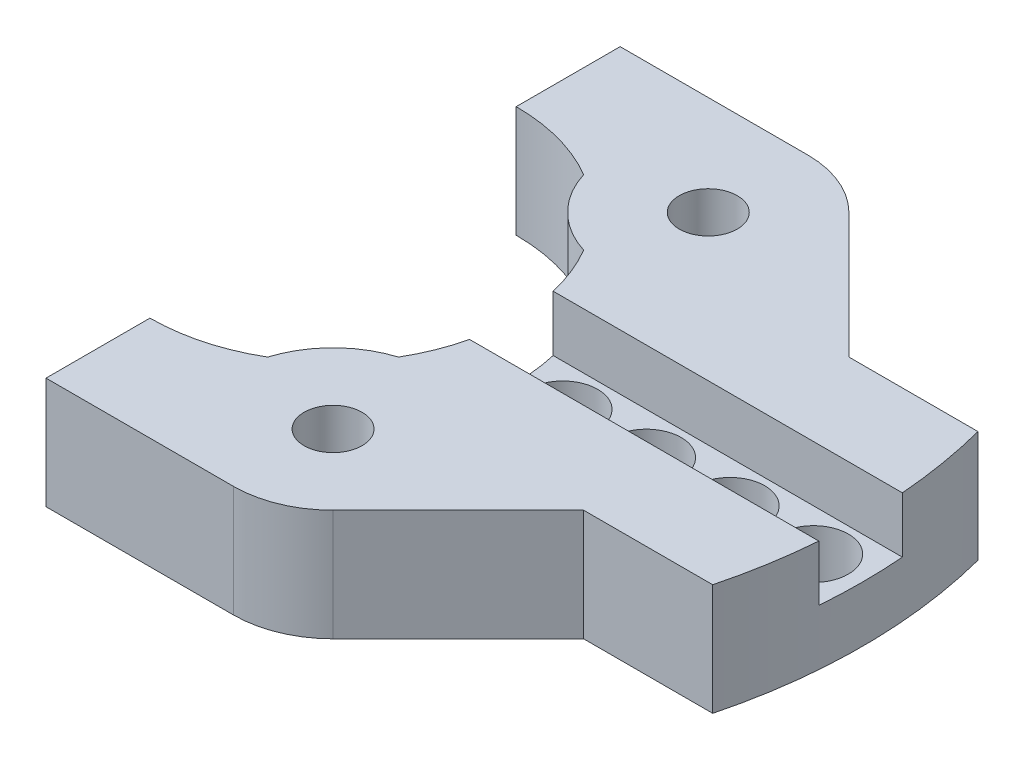
ISO-10303-21;
HEADER;
FILE_DESCRIPTION(('STEP AP214'),'2;1');
FILE_NAME('part.step','',(''),(''),'','','');
FILE_SCHEMA(('AUTOMOTIVE_DESIGN { 1 0 10303 214 1 1 1 1 }'));
ENDSEC;
DATA;
#1=APPLICATION_CONTEXT('core data for automotive mechanical design processes');
#2=APPLICATION_PROTOCOL_DEFINITION('international standard','automotive_design',2000,#1);
#3=PRODUCT_CONTEXT('',#1,'mechanical');
#4=PRODUCT('Part','Part','',(#3));
#5=PRODUCT_RELATED_PRODUCT_CATEGORY('part','',(#4));
#6=PRODUCT_DEFINITION_FORMATION('','',#4);
#7=PRODUCT_DEFINITION_CONTEXT('part definition',#1,'design');
#8=PRODUCT_DEFINITION('design','',#6,#7);
#9=PRODUCT_DEFINITION_SHAPE('','',#8);
#10=(LENGTH_UNIT() NAMED_UNIT(*) SI_UNIT(.MILLI.,.METRE.));
#11=(NAMED_UNIT(*) PLANE_ANGLE_UNIT() SI_UNIT($,.RADIAN.));
#12=(NAMED_UNIT(*) SI_UNIT($,.STERADIAN.) SOLID_ANGLE_UNIT());
#13=UNCERTAINTY_MEASURE_WITH_UNIT(LENGTH_MEASURE(1.E-05),#10,'distance_accuracy_value','');
#14=(GEOMETRIC_REPRESENTATION_CONTEXT(3) GLOBAL_UNCERTAINTY_ASSIGNED_CONTEXT((#13)) GLOBAL_UNIT_ASSIGNED_CONTEXT((#10,
#11,#12)) REPRESENTATION_CONTEXT('',''));
#15=CARTESIAN_POINT('',(0.,0.,0.));
#16=DIRECTION('',(0.,0.,1.));
#17=DIRECTION('',(1.,0.,0.));
#18=AXIS2_PLACEMENT_3D('',#15,#16,#17);
#19=CARTESIAN_POINT('',(0.,4.,0.));
#20=DIRECTION('',(0.,1.,0.));
#21=DIRECTION('',(0.,0.,1.));
#22=AXIS2_PLACEMENT_3D('',#19,#20,#21);
#23=PLANE('',#22);
#24=DIRECTION('',(-1.,0.,0.));
#25=VECTOR('',#24,1.);
#26=CARTESIAN_POINT('',(12.8044576317993,4.,-3.));
#27=LINE('',#26,#25);
#28=CARTESIAN_POINT('',(37.8813938497516,4.,-3.));
#29=VERTEX_POINT('',#28);
#30=CARTESIAN_POINT('',(12.8044576317993,4.,-3.));
#31=VERTEX_POINT('',#30);
#32=EDGE_CURVE('E191',#29,#31,#27,.T.);
#33=ORIENTED_EDGE('',*,*,#32,.F.);
#34=CARTESIAN_POINT('',(0.,4.,0.));
#35=DIRECTION('',(0.,1.,0.));
#36=DIRECTION('',(0.,0.,1.));
#37=AXIS2_PLACEMENT_3D('',#34,#35,#36);
#38=CIRCLE('',#37,38.);
#39=CARTESIAN_POINT('',(36.7868777555258,4.,-9.525));
#40=VERTEX_POINT('',#39);
#41=EDGE_CURVE('E288',#29,#40,#38,.T.);
#42=ORIENTED_EDGE('',*,*,#41,.T.);
#43=DIRECTION('',(-1.,0.,0.));
#44=VECTOR('',#43,1.);
#45=CARTESIAN_POINT('',(27.518556454203,4.,-9.525));
#46=LINE('',#45,#44);
#47=CARTESIAN_POINT('',(27.518556454203,4.,-9.525));
#48=VERTEX_POINT('',#47);
#49=EDGE_CURVE('E287',#40,#48,#46,.T.);
#50=ORIENTED_EDGE('',*,*,#49,.T.);
#51=DIRECTION('',(-0.707106781186556,0.,-0.707106781186539));
#52=VECTOR('',#51,1.);
#53=CARTESIAN_POINT('',(18.5217782271014,4.,-18.5217782271014));
#54=LINE('',#53,#52);
#55=CARTESIAN_POINT('',(18.5217782271014,4.,-18.5217782271014));
#56=VERTEX_POINT('',#55);
#57=EDGE_CURVE('E290',#48,#56,#54,.T.);
#58=ORIENTED_EDGE('',*,*,#57,.T.);
#59=CARTESIAN_POINT('',(13.470384159,4.,-13.470384159));
#60=DIRECTION('',(0.,1.,0.));
#61=DIRECTION('',(0.,0.,-1.));
#62=AXIS2_PLACEMENT_3D('',#59,#60,#61);
#63=CIRCLE('',#62,7.14375);
#64=CARTESIAN_POINT('',(13.470384159,4.,-20.614134159));
#65=VERTEX_POINT('',#64);
#66=EDGE_CURVE('E292',#56,#65,#63,.T.);
#67=ORIENTED_EDGE('',*,*,#66,.T.);
#68=DIRECTION('',(-1.,0.,0.));
#69=VECTOR('',#68,1.);
#70=CARTESIAN_POINT('',(13.470384159,4.,-20.614134159));
#71=LINE('',#70,#69);
#72=CARTESIAN_POINT('',(0.,4.,-20.614134159));
#73=VERTEX_POINT('',#72);
#74=EDGE_CURVE('E294',#65,#73,#71,.T.);
#75=ORIENTED_EDGE('',*,*,#74,.T.);
#76=DIRECTION('',(0.,0.,1.));
#77=VECTOR('',#76,1.);
#78=CARTESIAN_POINT('',(0.,4.,-20.614134159));
#79=LINE('',#78,#77);
#80=CARTESIAN_POINT('',(0.,4.,-13.151202806));
#81=VERTEX_POINT('',#80);
#82=EDGE_CURVE('E296',#73,#81,#79,.T.);
#83=ORIENTED_EDGE('',*,*,#82,.T.);
#84=CARTESIAN_POINT('',(0.,4.,0.));
#85=DIRECTION('',(0.,-1.,0.));
#86=DIRECTION('',(0.,0.,1.));
#87=AXIS2_PLACEMENT_3D('',#84,#85,#86);
#88=CIRCLE('',#87,13.151202806);
#89=CARTESIAN_POINT('',(6.64977572967821,4.,-11.3461278852975));
#90=VERTEX_POINT('',#89);
#91=EDGE_CURVE('E298',#81,#90,#88,.T.);
#92=ORIENTED_EDGE('',*,*,#91,.T.);
#93=CARTESIAN_POINT('',(13.470384159,4.,-13.470384159));
#94=DIRECTION('',(0.,1.,0.));
#95=DIRECTION('',(0.,0.,1.));
#96=AXIS2_PLACEMENT_3D('',#93,#94,#95);
#97=CIRCLE('',#96,7.14375);
#98=CARTESIAN_POINT('',(11.3461278852975,4.,-6.64977572967821));
#99=VERTEX_POINT('',#98);
#100=EDGE_CURVE('E300',#90,#99,#97,.T.);
#101=ORIENTED_EDGE('',*,*,#100,.T.);
#102=CARTESIAN_POINT('',(0.,4.,0.));
#103=DIRECTION('',(0.,-1.,0.));
#104=DIRECTION('',(0.,0.,1.));
#105=AXIS2_PLACEMENT_3D('',#102,#103,#104);
#106=CIRCLE('',#105,13.151202806);
#107=EDGE_CURVE('E302',#99,#31,#106,.T.);
#108=ORIENTED_EDGE('',*,*,#107,.T.);
#109=EDGE_LOOP('',(#33,#42,#50,#58,#67,#75,#83,#92,#101,#108));
#110=FACE_BOUND('',#109,.T.);
#111=CARTESIAN_POINT('',(13.470384159,4.,-13.470384159));
#112=DIRECTION('',(0.,1.,0.));
#113=DIRECTION('',(0.,0.,1.));
#114=AXIS2_PLACEMENT_3D('',#111,#112,#113);
#115=CIRCLE('',#114,2.0828);
#116=CARTESIAN_POINT('',(13.470384159,4.,-11.387584159));
#117=VERTEX_POINT('',#116);
#118=EDGE_CURVE('E279',#117,#117,#115,.T.);
#119=ORIENTED_EDGE('',*,*,#118,.F.);
#120=EDGE_LOOP('',(#119));
#121=FACE_BOUND('',#120,.T.);
#122=ADVANCED_FACE('F37',(#110,#121),#23,.T.);
#123=CARTESIAN_POINT('',(16.5,4.,0.));
#124=DIRECTION('',(0.,-1.,0.));
#125=DIRECTION('',(0.,0.,-1.));
#126=AXIS2_PLACEMENT_3D('',#123,#124,#125);
#127=CYLINDRICAL_SURFACE('',#126,2.5);
#128=CARTESIAN_POINT('',(16.5,-4.,0.));
#129=DIRECTION('',(0.,-1.,0.));
#130=DIRECTION('',(0.,0.,-1.));
#131=AXIS2_PLACEMENT_3D('',#128,#129,#130);
#132=CIRCLE('',#131,2.5);
#133=CARTESIAN_POINT('',(16.5,-4.,-2.5));
#134=VERTEX_POINT('',#133);
#135=EDGE_CURVE('E265',#134,#134,#132,.F.);
#136=ORIENTED_EDGE('',*,*,#135,.F.);
#137=EDGE_LOOP('',(#136));
#138=FACE_BOUND('',#137,.T.);
#139=CARTESIAN_POINT('',(16.5,0.,0.));
#140=DIRECTION('',(0.,1.,0.));
#141=DIRECTION('',(0.,0.,1.));
#142=AXIS2_PLACEMENT_3D('',#139,#140,#141);
#143=CIRCLE('',#142,2.5);
#144=CARTESIAN_POINT('',(16.5,0.,2.5));
#145=VERTEX_POINT('',#144);
#146=EDGE_CURVE('E209',#145,#145,#143,.T.);
#147=ORIENTED_EDGE('',*,*,#146,.T.);
#148=EDGE_LOOP('',(#147));
#149=FACE_BOUND('',#148,.T.);
#150=ADVANCED_FACE('F444',(#138,#149),#127,.F.);
#151=CARTESIAN_POINT('',(22.5,4.,0.));
#152=DIRECTION('',(0.,-1.,0.));
#153=DIRECTION('',(0.,0.,-1.));
#154=AXIS2_PLACEMENT_3D('',#151,#152,#153);
#155=CYLINDRICAL_SURFACE('',#154,2.5);
#156=CARTESIAN_POINT('',(22.5,-4.,0.));
#157=DIRECTION('',(0.,-1.,0.));
#158=DIRECTION('',(0.,0.,-1.));
#159=AXIS2_PLACEMENT_3D('',#156,#157,#158);
#160=CIRCLE('',#159,2.5);
#161=CARTESIAN_POINT('',(22.5,-4.,-2.5));
#162=VERTEX_POINT('',#161);
#163=EDGE_CURVE('E213',#162,#162,#160,.F.);
#164=ORIENTED_EDGE('',*,*,#163,.F.);
#165=EDGE_LOOP('',(#164));
#166=FACE_BOUND('',#165,.T.);
#167=CARTESIAN_POINT('',(22.5,0.,0.));
#168=DIRECTION('',(0.,1.,0.));
#169=DIRECTION('',(0.,0.,1.));
#170=AXIS2_PLACEMENT_3D('',#167,#168,#169);
#171=CIRCLE('',#170,2.5);
#172=CARTESIAN_POINT('',(22.5,0.,2.5));
#173=VERTEX_POINT('',#172);
#174=EDGE_CURVE('E206',#173,#173,#171,.T.);
#175=ORIENTED_EDGE('',*,*,#174,.T.);
#176=EDGE_LOOP('',(#175));
#177=FACE_BOUND('',#176,.T.);
#178=ADVANCED_FACE('F448',(#166,#177),#155,.F.);
#179=CARTESIAN_POINT('',(28.5,4.,0.));
#180=DIRECTION('',(0.,-1.,0.));
#181=DIRECTION('',(0.,0.,-1.));
#182=AXIS2_PLACEMENT_3D('',#179,#180,#181);
#183=CYLINDRICAL_SURFACE('',#182,2.5);
#184=CARTESIAN_POINT('',(28.5,-4.,0.));
#185=DIRECTION('',(0.,-1.,0.));
#186=DIRECTION('',(0.,0.,-1.));
#187=AXIS2_PLACEMENT_3D('',#184,#185,#186);
#188=CIRCLE('',#187,2.5);
#189=CARTESIAN_POINT('',(28.5,-4.,-2.5));
#190=VERTEX_POINT('',#189);
#191=EDGE_CURVE('E216',#190,#190,#188,.F.);
#192=ORIENTED_EDGE('',*,*,#191,.F.);
#193=EDGE_LOOP('',(#192));
#194=FACE_BOUND('',#193,.T.);
#195=CARTESIAN_POINT('',(28.5,0.,0.));
#196=DIRECTION('',(0.,1.,0.));
#197=DIRECTION('',(0.,0.,1.));
#198=AXIS2_PLACEMENT_3D('',#195,#196,#197);
#199=CIRCLE('',#198,2.5);
#200=CARTESIAN_POINT('',(28.5,0.,2.5));
#201=VERTEX_POINT('',#200);
#202=EDGE_CURVE('E203',#201,#201,#199,.T.);
#203=ORIENTED_EDGE('',*,*,#202,.T.);
#204=EDGE_LOOP('',(#203));
#205=FACE_BOUND('',#204,.T.);
#206=ADVANCED_FACE('F436',(#194,#205),#183,.F.);
#207=CARTESIAN_POINT('',(34.5,4.,0.));
#208=DIRECTION('',(0.,-1.,0.));
#209=DIRECTION('',(0.,0.,-1.));
#210=AXIS2_PLACEMENT_3D('',#207,#208,#209);
#211=CYLINDRICAL_SURFACE('',#210,2.5);
#212=CARTESIAN_POINT('',(34.5,-4.,0.));
#213=DIRECTION('',(0.,-1.,0.));
#214=DIRECTION('',(0.,0.,-1.));
#215=AXIS2_PLACEMENT_3D('',#212,#213,#214);
#216=CIRCLE('',#215,2.5);
#217=CARTESIAN_POINT('',(34.5,-4.,-2.5));
#218=VERTEX_POINT('',#217);
#219=EDGE_CURVE('E220',#218,#218,#216,.F.);
#220=ORIENTED_EDGE('',*,*,#219,.F.);
#221=EDGE_LOOP('',(#220));
#222=FACE_BOUND('',#221,.T.);
#223=CARTESIAN_POINT('',(34.5,0.,0.));
#224=DIRECTION('',(0.,1.,0.));
#225=DIRECTION('',(0.,0.,1.));
#226=AXIS2_PLACEMENT_3D('',#223,#224,#225);
#227=CIRCLE('',#226,2.5);
#228=CARTESIAN_POINT('',(34.5,0.,2.5));
#229=VERTEX_POINT('',#228);
#230=EDGE_CURVE('E41',#229,#229,#227,.T.);
#231=ORIENTED_EDGE('',*,*,#230,.T.);
#232=EDGE_LOOP('',(#231));
#233=FACE_BOUND('',#232,.T.);
#234=ADVANCED_FACE('F428',(#222,#233),#211,.F.);
#235=CARTESIAN_POINT('',(0.,0.,0.));
#236=DIRECTION('',(0.,1.,0.));
#237=DIRECTION('',(0.,0.,1.));
#238=AXIS2_PLACEMENT_3D('',#235,#236,#237);
#239=PLANE('',#238);
#240=CARTESIAN_POINT('',(13.470384159,0.,-13.470384159));
#241=DIRECTION('',(0.,1.,0.));
#242=DIRECTION('',(0.,0.,1.));
#243=AXIS2_PLACEMENT_3D('',#240,#241,#242);
#244=CIRCLE('',#243,7.14375);
#245=CARTESIAN_POINT('',(6.64977572967821,0.,-11.3461278852975));
#246=VERTEX_POINT('',#245);
#247=CARTESIAN_POINT('',(11.3461278852975,0.,-6.64977572967821));
#248=VERTEX_POINT('',#247);
#249=EDGE_CURVE('E282',#246,#248,#244,.T.);
#250=ORIENTED_EDGE('',*,*,#249,.F.);
#251=CARTESIAN_POINT('',(0.,0.,0.));
#252=DIRECTION('',(0.,-1.,0.));
#253=DIRECTION('',(0.,0.,-1.));
#254=AXIS2_PLACEMENT_3D('',#251,#252,#253);
#255=CIRCLE('',#254,13.151202806);
#256=EDGE_CURVE('E11',#246,#248,#255,.T.);
#257=ORIENTED_EDGE('',*,*,#256,.T.);
#258=EDGE_LOOP('',(#250,#257));
#259=FACE_BOUND('',#258,.T.);
#260=ADVANCED_FACE('F426',(#259),#239,.F.);
#261=CARTESIAN_POINT('',(13.470384159,0.,13.470384159));
#262=DIRECTION('',(0.,1.,0.));
#263=DIRECTION('',(0.,0.,-1.));
#264=AXIS2_PLACEMENT_3D('',#261,#262,#263);
#265=CIRCLE('',#264,7.14375);
#266=CARTESIAN_POINT('',(11.3461278852975,0.,6.64977572967821));
#267=VERTEX_POINT('',#266);
#268=CARTESIAN_POINT('',(6.64977572967821,0.,11.3461278852975));
#269=VERTEX_POINT('',#268);
#270=EDGE_CURVE('E321',#267,#269,#265,.T.);
#271=ORIENTED_EDGE('',*,*,#270,.F.);
#272=EDGE_CURVE('E46',#267,#269,#255,.T.);
#273=ORIENTED_EDGE('',*,*,#272,.T.);
#274=EDGE_LOOP('',(#271,#273));
#275=FACE_BOUND('',#274,.T.);
#276=ADVANCED_FACE('F364',(#275),#239,.F.);
#277=CARTESIAN_POINT('',(13.470384159,0.,13.470384159));
#278=DIRECTION('',(0.,1.,0.));
#279=DIRECTION('',(0.,0.,-1.));
#280=AXIS2_PLACEMENT_3D('',#277,#278,#279);
#281=CIRCLE('',#280,2.0828);
#282=CARTESIAN_POINT('',(13.470384159,0.,11.387584159));
#283=VERTEX_POINT('',#282);
#284=EDGE_CURVE('E267',#283,#283,#281,.T.);
#285=ORIENTED_EDGE('',*,*,#284,.T.);
#286=EDGE_LOOP('',(#285));
#287=FACE_BOUND('',#286,.T.);
#288=CARTESIAN_POINT('',(13.470384159,0.,13.470384159));
#289=DIRECTION('',(0.,-1.,0.));
#290=DIRECTION('',(0.,0.,-1.));
#291=AXIS2_PLACEMENT_3D('',#288,#289,#290);
#292=CIRCLE('',#291,3.429);
#293=CARTESIAN_POINT('',(13.470384159,0.,10.041384159));
#294=VERTEX_POINT('',#293);
#295=EDGE_CURVE('E212',#294,#294,#292,.T.);
#296=ORIENTED_EDGE('',*,*,#295,.T.);
#297=EDGE_LOOP('',(#296));
#298=FACE_BOUND('',#297,.T.);
#299=ADVANCED_FACE('F435',(#287,#298),#239,.F.);
#300=CARTESIAN_POINT('',(13.470384159,0.,-13.470384159));
#301=DIRECTION('',(0.,1.,0.));
#302=DIRECTION('',(0.,0.,1.));
#303=AXIS2_PLACEMENT_3D('',#300,#301,#302);
#304=CIRCLE('',#303,2.0828);
#305=CARTESIAN_POINT('',(13.470384159,0.,-11.387584159));
#306=VERTEX_POINT('',#305);
#307=EDGE_CURVE('E276',#306,#306,#304,.T.);
#308=ORIENTED_EDGE('',*,*,#307,.T.);
#309=EDGE_LOOP('',(#308));
#310=FACE_BOUND('',#309,.T.);
#311=CARTESIAN_POINT('',(13.470384159,0.,-13.470384159));
#312=DIRECTION('',(0.,-1.,0.));
#313=DIRECTION('',(0.,0.,-1.));
#314=AXIS2_PLACEMENT_3D('',#311,#312,#313);
#315=CIRCLE('',#314,3.429);
#316=CARTESIAN_POINT('',(13.470384159,0.,-16.899384159));
#317=VERTEX_POINT('',#316);
#318=EDGE_CURVE('E217',#317,#317,#315,.T.);
#319=ORIENTED_EDGE('',*,*,#318,.T.);
#320=EDGE_LOOP('',(#319));
#321=FACE_BOUND('',#320,.T.);
#322=ADVANCED_FACE('F430',(#310,#321),#239,.F.);
#323=DIRECTION('',(1.,0.,0.));
#324=VECTOR('',#323,1.);
#325=CARTESIAN_POINT('',(12.8044576317993,4.,3.));
#326=LINE('',#325,#324);
#327=CARTESIAN_POINT('',(12.8044576317993,4.,3.));
#328=VERTEX_POINT('',#327);
#329=CARTESIAN_POINT('',(37.8813938497516,4.,3.));
#330=VERTEX_POINT('',#329);
#331=EDGE_CURVE('E375',#328,#330,#326,.T.);
#332=ORIENTED_EDGE('',*,*,#331,.F.);
#333=CARTESIAN_POINT('',(11.3461278852975,4.,6.64977572967821));
#334=VERTEX_POINT('',#333);
#335=EDGE_CURVE('E196',#328,#334,#106,.T.);
#336=ORIENTED_EDGE('',*,*,#335,.T.);
#337=CARTESIAN_POINT('',(13.470384159,4.,13.470384159));
#338=DIRECTION('',(0.,1.,0.));
#339=DIRECTION('',(0.,0.,-1.));
#340=AXIS2_PLACEMENT_3D('',#337,#338,#339);
#341=CIRCLE('',#340,7.14375);
#342=CARTESIAN_POINT('',(6.64977572967821,4.,11.3461278852975));
#343=VERTEX_POINT('',#342);
#344=EDGE_CURVE('E305',#334,#343,#341,.T.);
#345=ORIENTED_EDGE('',*,*,#344,.T.);
#346=CARTESIAN_POINT('',(0.,4.,0.));
#347=DIRECTION('',(0.,-1.,0.));
#348=DIRECTION('',(0.,0.,-1.));
#349=AXIS2_PLACEMENT_3D('',#346,#347,#348);
#350=CIRCLE('',#349,13.151202806);
#351=CARTESIAN_POINT('',(0.,4.,13.151202806));
#352=VERTEX_POINT('',#351);
#353=EDGE_CURVE('E307',#343,#352,#350,.T.);
#354=ORIENTED_EDGE('',*,*,#353,.T.);
#355=DIRECTION('',(0.,0.,1.));
#356=VECTOR('',#355,1.);
#357=CARTESIAN_POINT('',(0.,4.,20.614134159));
#358=LINE('',#357,#356);
#359=CARTESIAN_POINT('',(0.,4.,20.614134159));
#360=VERTEX_POINT('',#359);
#361=EDGE_CURVE('E309',#352,#360,#358,.T.);
#362=ORIENTED_EDGE('',*,*,#361,.T.);
#363=DIRECTION('',(1.,0.,0.));
#364=VECTOR('',#363,1.);
#365=CARTESIAN_POINT('',(13.470384159,4.,20.614134159));
#366=LINE('',#365,#364);
#367=CARTESIAN_POINT('',(13.470384159,4.,20.614134159));
#368=VERTEX_POINT('',#367);
#369=EDGE_CURVE('E311',#360,#368,#366,.T.);
#370=ORIENTED_EDGE('',*,*,#369,.T.);
#371=CARTESIAN_POINT('',(13.470384159,4.,13.470384159));
#372=DIRECTION('',(0.,1.,0.));
#373=DIRECTION('',(0.,0.,1.));
#374=AXIS2_PLACEMENT_3D('',#371,#372,#373);
#375=CIRCLE('',#374,7.14375);
#376=CARTESIAN_POINT('',(18.5217782271014,4.,18.5217782271014));
#377=VERTEX_POINT('',#376);
#378=EDGE_CURVE('E313',#368,#377,#375,.T.);
#379=ORIENTED_EDGE('',*,*,#378,.T.);
#380=DIRECTION('',(0.707106781186556,0.,-0.707106781186539));
#381=VECTOR('',#380,1.);
#382=CARTESIAN_POINT('',(18.5217782271014,4.,18.5217782271014));
#383=LINE('',#382,#381);
#384=CARTESIAN_POINT('',(27.518556454203,4.,9.525));
#385=VERTEX_POINT('',#384);
#386=EDGE_CURVE('E315',#377,#385,#383,.T.);
#387=ORIENTED_EDGE('',*,*,#386,.T.);
#388=DIRECTION('',(1.,0.,0.));
#389=VECTOR('',#388,1.);
#390=CARTESIAN_POINT('',(27.518556454203,4.,9.525));
#391=LINE('',#390,#389);
#392=CARTESIAN_POINT('',(36.7868777555258,4.,9.525));
#393=VERTEX_POINT('',#392);
#394=EDGE_CURVE('E62',#385,#393,#391,.T.);
#395=ORIENTED_EDGE('',*,*,#394,.T.);
#396=EDGE_CURVE('E285',#393,#330,#38,.T.);
#397=ORIENTED_EDGE('',*,*,#396,.T.);
#398=EDGE_LOOP('',(#332,#336,#345,#354,#362,#370,#379,#387,#395,#397));
#399=FACE_BOUND('',#398,.T.);
#400=CARTESIAN_POINT('',(13.470384159,4.,13.470384159));
#401=DIRECTION('',(0.,1.,0.));
#402=DIRECTION('',(0.,0.,-1.));
#403=AXIS2_PLACEMENT_3D('',#400,#401,#402);
#404=CIRCLE('',#403,2.0828);
#405=CARTESIAN_POINT('',(13.470384159,4.,11.387584159));
#406=VERTEX_POINT('',#405);
#407=EDGE_CURVE('E273',#406,#406,#404,.T.);
#408=ORIENTED_EDGE('',*,*,#407,.F.);
#409=EDGE_LOOP('',(#408));
#410=FACE_BOUND('',#409,.T.);
#411=ADVANCED_FACE('F372',(#399,#410),#23,.T.);
#412=CARTESIAN_POINT('',(0.,4.,0.));
#413=DIRECTION('',(0.,-1.,0.));
#414=DIRECTION('',(0.,0.,-1.));
#415=AXIS2_PLACEMENT_3D('',#412,#413,#414);
#416=CYLINDRICAL_SURFACE('',#415,38.);
#417=ORIENTED_EDGE('',*,*,#41,.F.);
#418=DIRECTION('',(0.,1.,0.));
#419=VECTOR('',#418,1.);
#420=CARTESIAN_POINT('',(37.8813938497516,0.,-3.));
#421=LINE('',#420,#419);
#422=CARTESIAN_POINT('',(37.8813938497516,0.,-3.));
#423=VERTEX_POINT('',#422);
#424=EDGE_CURVE('E198',#423,#29,#421,.T.);
#425=ORIENTED_EDGE('',*,*,#424,.F.);
#426=CARTESIAN_POINT('',(0.,0.,0.));
#427=DIRECTION('',(0.,1.,0.));
#428=DIRECTION('',(0.,0.,1.));
#429=AXIS2_PLACEMENT_3D('',#426,#427,#428);
#430=CIRCLE('',#429,38.);
#431=CARTESIAN_POINT('',(37.8813938497516,0.,3.));
#432=VERTEX_POINT('',#431);
#433=EDGE_CURVE('E184',#432,#423,#430,.T.);
#434=ORIENTED_EDGE('',*,*,#433,.F.);
#435=DIRECTION('',(0.,1.,0.));
#436=VECTOR('',#435,1.);
#437=CARTESIAN_POINT('',(37.8813938497516,0.,3.));
#438=LINE('',#437,#436);
#439=EDGE_CURVE('E182',#432,#330,#438,.T.);
#440=ORIENTED_EDGE('',*,*,#439,.T.);
#441=ORIENTED_EDGE('',*,*,#396,.F.);
#442=DIRECTION('',(0.,-1.,0.));
#443=VECTOR('',#442,1.);
#444=CARTESIAN_POINT('',(36.7868777555258,4.,9.525));
#445=LINE('',#444,#443);
#446=CARTESIAN_POINT('',(36.7868777555258,-4.,9.525));
#447=VERTEX_POINT('',#446);
#448=EDGE_CURVE('E318',#393,#447,#445,.T.);
#449=ORIENTED_EDGE('',*,*,#448,.T.);
#450=CARTESIAN_POINT('',(0.,-4.,0.));
#451=DIRECTION('',(0.,-1.,0.));
#452=DIRECTION('',(0.,0.,-1.));
#453=AXIS2_PLACEMENT_3D('',#450,#451,#452);
#454=CIRCLE('',#453,38.);
#455=CARTESIAN_POINT('',(36.7868777555258,-4.,-9.525));
#456=VERTEX_POINT('',#455);
#457=EDGE_CURVE('E241',#456,#447,#454,.T.);
#458=ORIENTED_EDGE('',*,*,#457,.F.);
#459=DIRECTION('',(0.,-1.,0.));
#460=VECTOR('',#459,1.);
#461=CARTESIAN_POINT('',(36.7868777555258,4.,-9.525));
#462=LINE('',#461,#460);
#463=EDGE_CURVE('E356',#40,#456,#462,.T.);
#464=ORIENTED_EDGE('',*,*,#463,.F.);
#465=EDGE_LOOP('',(#417,#425,#434,#440,#441,#449,#458,#464));
#466=FACE_BOUND('',#465,.T.);
#467=ADVANCED_FACE('F39',(#466),#416,.T.);
#468=CARTESIAN_POINT('',(27.518556454203,4.,-9.525));
#469=DIRECTION('',(0.,0.,1.));
#470=DIRECTION('',(1.,0.,0.));
#471=AXIS2_PLACEMENT_3D('',#468,#469,#470);
#472=PLANE('',#471);
#473=ORIENTED_EDGE('',*,*,#463,.T.);
#474=DIRECTION('',(1.,0.,0.));
#475=VECTOR('',#474,1.);
#476=CARTESIAN_POINT('',(0.,-4.,-9.52500000000001));
#477=LINE('',#476,#475);
#478=CARTESIAN_POINT('',(27.518556454203,-4.,-9.525));
#479=VERTEX_POINT('',#478);
#480=EDGE_CURVE('E238',#479,#456,#477,.T.);
#481=ORIENTED_EDGE('',*,*,#480,.F.);
#482=DIRECTION('',(0.,-1.,0.));
#483=VECTOR('',#482,1.);
#484=CARTESIAN_POINT('',(27.518556454203,4.,-9.525));
#485=LINE('',#484,#483);
#486=EDGE_CURVE('E355',#48,#479,#485,.T.);
#487=ORIENTED_EDGE('',*,*,#486,.F.);
#488=ORIENTED_EDGE('',*,*,#49,.F.);
#489=EDGE_LOOP('',(#473,#481,#487,#488));
#490=FACE_BOUND('',#489,.T.);
#491=ADVANCED_FACE('F398',(#490),#472,.F.);
#492=CARTESIAN_POINT('',(18.5217782271014,4.,-18.5217782271014));
#493=DIRECTION('',(-0.707106781186539,0.,0.707106781186556));
#494=DIRECTION('',(0.707106781186556,0.,0.707106781186539));
#495=AXIS2_PLACEMENT_3D('',#492,#493,#494);
#496=PLANE('',#495);
#497=ORIENTED_EDGE('',*,*,#486,.T.);
#498=DIRECTION('',(0.707106781186556,0.,0.707106781186539));
#499=VECTOR('',#498,1.);
#500=CARTESIAN_POINT('',(18.5217782271012,-4.,-18.5217782271016));
#501=LINE('',#500,#499);
#502=CARTESIAN_POINT('',(18.5217782271014,-4.,-18.5217782271014));
#503=VERTEX_POINT('',#502);
#504=EDGE_CURVE('E235',#503,#479,#501,.T.);
#505=ORIENTED_EDGE('',*,*,#504,.F.);
#506=DIRECTION('',(0.,-1.,0.));
#507=VECTOR('',#506,1.);
#508=CARTESIAN_POINT('',(18.5217782271014,4.,-18.5217782271014));
#509=LINE('',#508,#507);
#510=EDGE_CURVE('E353',#56,#503,#509,.T.);
#511=ORIENTED_EDGE('',*,*,#510,.F.);
#512=ORIENTED_EDGE('',*,*,#57,.F.);
#513=EDGE_LOOP('',(#497,#505,#511,#512));
#514=FACE_BOUND('',#513,.T.);
#515=ADVANCED_FACE('F402',(#514),#496,.F.);
#516=CARTESIAN_POINT('',(13.470384159,4.,-13.470384159));
#517=DIRECTION('',(0.,-1.,0.));
#518=DIRECTION('',(0.,0.,-1.));
#519=AXIS2_PLACEMENT_3D('',#516,#517,#518);
#520=CYLINDRICAL_SURFACE('',#519,7.14375);
#521=ORIENTED_EDGE('',*,*,#510,.T.);
#522=CARTESIAN_POINT('',(13.470384159,-4.,-13.470384159));
#523=DIRECTION('',(0.,-1.,0.));
#524=DIRECTION('',(0.,0.,-1.));
#525=AXIS2_PLACEMENT_3D('',#522,#523,#524);
#526=CIRCLE('',#525,7.14375);
#527=CARTESIAN_POINT('',(13.470384159,-4.,-20.614134159));
#528=VERTEX_POINT('',#527);
#529=EDGE_CURVE('E232',#528,#503,#526,.T.);
#530=ORIENTED_EDGE('',*,*,#529,.F.);
#531=DIRECTION('',(0.,-1.,0.));
#532=VECTOR('',#531,1.);
#533=CARTESIAN_POINT('',(13.470384159,4.,-20.614134159));
#534=LINE('',#533,#532);
#535=EDGE_CURVE('E351',#65,#528,#534,.T.);
#536=ORIENTED_EDGE('',*,*,#535,.F.);
#537=ORIENTED_EDGE('',*,*,#66,.F.);
#538=EDGE_LOOP('',(#521,#530,#536,#537));
#539=FACE_BOUND('',#538,.T.);
#540=ADVANCED_FACE('F409',(#539),#520,.T.);
#541=CARTESIAN_POINT('',(13.470384159,4.,-20.614134159));
#542=DIRECTION('',(0.,0.,1.));
#543=DIRECTION('',(1.,0.,0.));
#544=AXIS2_PLACEMENT_3D('',#541,#542,#543);
#545=PLANE('',#544);
#546=ORIENTED_EDGE('',*,*,#535,.T.);
#547=DIRECTION('',(1.,0.,0.));
#548=VECTOR('',#547,1.);
#549=CARTESIAN_POINT('',(0.,-4.,-20.614134159));
#550=LINE('',#549,#548);
#551=CARTESIAN_POINT('',(0.,-4.,-20.614134159));
#552=VERTEX_POINT('',#551);
#553=EDGE_CURVE('E229',#552,#528,#550,.T.);
#554=ORIENTED_EDGE('',*,*,#553,.F.);
#555=DIRECTION('',(0.,-1.,0.));
#556=VECTOR('',#555,1.);
#557=CARTESIAN_POINT('',(0.,4.,-20.614134159));
#558=LINE('',#557,#556);
#559=EDGE_CURVE('E349',#73,#552,#558,.T.);
#560=ORIENTED_EDGE('',*,*,#559,.F.);
#561=ORIENTED_EDGE('',*,*,#74,.F.);
#562=EDGE_LOOP('',(#546,#554,#560,#561));
#563=FACE_BOUND('',#562,.T.);
#564=ADVANCED_FACE('F412',(#563),#545,.F.);
#565=CARTESIAN_POINT('',(0.,4.,-20.614134159));
#566=DIRECTION('',(1.,0.,0.));
#567=DIRECTION('',(0.,0.,-1.));
#568=AXIS2_PLACEMENT_3D('',#565,#566,#567);
#569=PLANE('',#568);
#570=ORIENTED_EDGE('',*,*,#559,.T.);
#571=DIRECTION('',(0.,0.,-1.));
#572=VECTOR('',#571,1.);
#573=CARTESIAN_POINT('',(0.,-4.,0.));
#574=LINE('',#573,#572);
#575=CARTESIAN_POINT('',(0.,-4.,-13.151202806));
#576=VERTEX_POINT('',#575);
#577=EDGE_CURVE('E226',#576,#552,#574,.T.);
#578=ORIENTED_EDGE('',*,*,#577,.F.);
#579=DIRECTION('',(0.,-1.,0.));
#580=VECTOR('',#579,1.);
#581=CARTESIAN_POINT('',(0.,4.,-13.151202806));
#582=LINE('',#581,#580);
#583=EDGE_CURVE('E347',#81,#576,#582,.T.);
#584=ORIENTED_EDGE('',*,*,#583,.F.);
#585=ORIENTED_EDGE('',*,*,#82,.F.);
#586=EDGE_LOOP('',(#570,#578,#584,#585));
#587=FACE_BOUND('',#586,.T.);
#588=ADVANCED_FACE('F417',(#587),#569,.F.);
#589=CARTESIAN_POINT('',(13.470384159,4.,-13.470384159));
#590=DIRECTION('',(0.,-1.,0.));
#591=DIRECTION('',(0.,0.,-1.));
#592=AXIS2_PLACEMENT_3D('',#589,#590,#591);
#593=CYLINDRICAL_SURFACE('',#592,7.14375);
#594=ORIENTED_EDGE('',*,*,#249,.T.);
#595=DIRECTION('',(0.,-1.,0.));
#596=VECTOR('',#595,1.);
#597=CARTESIAN_POINT('',(11.3461278852975,4.,-6.64977572967821));
#598=LINE('',#597,#596);
#599=EDGE_CURVE('E341',#99,#248,#598,.T.);
#600=ORIENTED_EDGE('',*,*,#599,.F.);
#601=ORIENTED_EDGE('',*,*,#100,.F.);
#602=DIRECTION('',(0.,-1.,0.));
#603=VECTOR('',#602,1.);
#604=CARTESIAN_POINT('',(6.64977572967821,4.,-11.3461278852975));
#605=LINE('',#604,#603);
#606=EDGE_CURVE('E344',#90,#246,#605,.T.);
#607=ORIENTED_EDGE('',*,*,#606,.T.);
#608=EDGE_LOOP('',(#594,#600,#601,#607));
#609=FACE_BOUND('',#608,.T.);
#610=ADVANCED_FACE('F424',(#609),#593,.T.);
#611=CARTESIAN_POINT('',(13.470384159,4.,13.470384159));
#612=DIRECTION('',(0.,-1.,0.));
#613=DIRECTION('',(0.,0.,-1.));
#614=AXIS2_PLACEMENT_3D('',#611,#612,#613);
#615=CYLINDRICAL_SURFACE('',#614,7.14375);
#616=ORIENTED_EDGE('',*,*,#270,.T.);
#617=DIRECTION('',(0.,-1.,0.));
#618=VECTOR('',#617,1.);
#619=CARTESIAN_POINT('',(6.64977572967821,4.,11.3461278852975));
#620=LINE('',#619,#618);
#621=EDGE_CURVE('E335',#343,#269,#620,.T.);
#622=ORIENTED_EDGE('',*,*,#621,.F.);
#623=ORIENTED_EDGE('',*,*,#344,.F.);
#624=DIRECTION('',(0.,-1.,0.));
#625=VECTOR('',#624,1.);
#626=CARTESIAN_POINT('',(11.3461278852975,4.,6.64977572967821));
#627=LINE('',#626,#625);
#628=EDGE_CURVE('E338',#334,#267,#627,.T.);
#629=ORIENTED_EDGE('',*,*,#628,.T.);
#630=EDGE_LOOP('',(#616,#622,#623,#629));
#631=FACE_BOUND('',#630,.T.);
#632=ADVANCED_FACE('F367',(#631),#615,.T.);
#633=CARTESIAN_POINT('',(0.,4.,0.));
#634=DIRECTION('',(0.,-1.,0.));
#635=DIRECTION('',(0.,0.,-1.));
#636=AXIS2_PLACEMENT_3D('',#633,#634,#635);
#637=CYLINDRICAL_SURFACE('',#636,13.151202806);
#638=CARTESIAN_POINT('',(0.,0.,0.));
#639=DIRECTION('',(0.,-1.,0.));
#640=DIRECTION('',(0.,0.,1.));
#641=AXIS2_PLACEMENT_3D('',#638,#639,#640);
#642=CIRCLE('',#641,13.151202806);
#643=CARTESIAN_POINT('',(12.8044576317993,0.,-3.));
#644=VERTEX_POINT('',#643);
#645=CARTESIAN_POINT('',(12.8044576317993,0.,3.));
#646=VERTEX_POINT('',#645);
#647=EDGE_CURVE('E185',#644,#646,#642,.T.);
#648=ORIENTED_EDGE('',*,*,#647,.F.);
#649=DIRECTION('',(0.,1.,0.));
#650=VECTOR('',#649,1.);
#651=CARTESIAN_POINT('',(12.8044576317993,0.,-3.));
#652=LINE('',#651,#650);
#653=EDGE_CURVE('E381',#644,#31,#652,.T.);
#654=ORIENTED_EDGE('',*,*,#653,.T.);
#655=ORIENTED_EDGE('',*,*,#107,.F.);
#656=ORIENTED_EDGE('',*,*,#599,.T.);
#657=ORIENTED_EDGE('',*,*,#256,.F.);
#658=ORIENTED_EDGE('',*,*,#606,.F.);
#659=ORIENTED_EDGE('',*,*,#91,.F.);
#660=ORIENTED_EDGE('',*,*,#583,.T.);
#661=CARTESIAN_POINT('',(0.,-4.,0.));
#662=DIRECTION('',(0.,-1.,0.));
#663=DIRECTION('',(0.,0.,-1.));
#664=AXIS2_PLACEMENT_3D('',#661,#662,#663);
#665=CIRCLE('',#664,13.151202806);
#666=CARTESIAN_POINT('',(0.,-4.,13.151202806));
#667=VERTEX_POINT('',#666);
#668=EDGE_CURVE('E223',#576,#667,#665,.T.);
#669=ORIENTED_EDGE('',*,*,#668,.T.);
#670=DIRECTION('',(0.,-1.,0.));
#671=VECTOR('',#670,1.);
#672=CARTESIAN_POINT('',(0.,4.,13.151202806));
#673=LINE('',#672,#671);
#674=EDGE_CURVE('E333',#352,#667,#673,.T.);
#675=ORIENTED_EDGE('',*,*,#674,.F.);
#676=ORIENTED_EDGE('',*,*,#353,.F.);
#677=ORIENTED_EDGE('',*,*,#621,.T.);
#678=ORIENTED_EDGE('',*,*,#272,.F.);
#679=ORIENTED_EDGE('',*,*,#628,.F.);
#680=ORIENTED_EDGE('',*,*,#335,.F.);
#681=DIRECTION('',(0.,1.,0.));
#682=VECTOR('',#681,1.);
#683=CARTESIAN_POINT('',(12.8044576317993,0.,3.));
#684=LINE('',#683,#682);
#685=EDGE_CURVE('E179',#646,#328,#684,.T.);
#686=ORIENTED_EDGE('',*,*,#685,.F.);
#687=EDGE_LOOP('',(#648,#654,#655,#656,#657,#658,#659,#660,#669,#675,#676,#677,#678,#679,#680,#686));
#688=FACE_BOUND('',#687,.T.);
#689=ADVANCED_FACE('F194',(#688),#637,.F.);
#690=CARTESIAN_POINT('',(0.,4.,20.614134159));
#691=DIRECTION('',(1.,0.,0.));
#692=DIRECTION('',(0.,0.,-1.));
#693=AXIS2_PLACEMENT_3D('',#690,#691,#692);
#694=PLANE('',#693);
#695=ORIENTED_EDGE('',*,*,#674,.T.);
#696=DIRECTION('',(0.,0.,-1.));
#697=VECTOR('',#696,1.);
#698=CARTESIAN_POINT('',(0.,-4.,0.));
#699=LINE('',#698,#697);
#700=CARTESIAN_POINT('',(0.,-4.,20.614134159));
#701=VERTEX_POINT('',#700);
#702=EDGE_CURVE('E256',#701,#667,#699,.T.);
#703=ORIENTED_EDGE('',*,*,#702,.F.);
#704=DIRECTION('',(0.,-1.,0.));
#705=VECTOR('',#704,1.);
#706=CARTESIAN_POINT('',(0.,4.,20.614134159));
#707=LINE('',#706,#705);
#708=EDGE_CURVE('E331',#360,#701,#707,.T.);
#709=ORIENTED_EDGE('',*,*,#708,.F.);
#710=ORIENTED_EDGE('',*,*,#361,.F.);
#711=EDGE_LOOP('',(#695,#703,#709,#710));
#712=FACE_BOUND('',#711,.T.);
#713=ADVANCED_FACE('F476',(#712),#694,.F.);
#714=CARTESIAN_POINT('',(13.470384159,4.,20.614134159));
#715=DIRECTION('',(0.,0.,-1.));
#716=DIRECTION('',(-1.,0.,0.));
#717=AXIS2_PLACEMENT_3D('',#714,#715,#716);
#718=PLANE('',#717);
#719=ORIENTED_EDGE('',*,*,#708,.T.);
#720=DIRECTION('',(-1.,0.,0.));
#721=VECTOR('',#720,1.);
#722=CARTESIAN_POINT('',(0.,-4.,20.614134159));
#723=LINE('',#722,#721);
#724=CARTESIAN_POINT('',(13.470384159,-4.,20.614134159));
#725=VERTEX_POINT('',#724);
#726=EDGE_CURVE('E253',#725,#701,#723,.T.);
#727=ORIENTED_EDGE('',*,*,#726,.F.);
#728=DIRECTION('',(0.,-1.,0.));
#729=VECTOR('',#728,1.);
#730=CARTESIAN_POINT('',(13.470384159,4.,20.614134159));
#731=LINE('',#730,#729);
#732=EDGE_CURVE('E329',#368,#725,#731,.T.);
#733=ORIENTED_EDGE('',*,*,#732,.F.);
#734=ORIENTED_EDGE('',*,*,#369,.F.);
#735=EDGE_LOOP('',(#719,#727,#733,#734));
#736=FACE_BOUND('',#735,.T.);
#737=ADVANCED_FACE('F479',(#736),#718,.F.);
#738=CARTESIAN_POINT('',(13.470384159,4.,13.470384159));
#739=DIRECTION('',(0.,-1.,0.));
#740=DIRECTION('',(0.,0.,-1.));
#741=AXIS2_PLACEMENT_3D('',#738,#739,#740);
#742=CYLINDRICAL_SURFACE('',#741,7.14375);
#743=ORIENTED_EDGE('',*,*,#732,.T.);
#744=CARTESIAN_POINT('',(13.470384159,-4.,13.470384159));
#745=DIRECTION('',(0.,-1.,0.));
#746=DIRECTION('',(0.,0.,-1.));
#747=AXIS2_PLACEMENT_3D('',#744,#745,#746);
#748=CIRCLE('',#747,7.14375);
#749=CARTESIAN_POINT('',(18.5217782271014,-4.,18.5217782271014));
#750=VERTEX_POINT('',#749);
#751=EDGE_CURVE('E250',#750,#725,#748,.T.);
#752=ORIENTED_EDGE('',*,*,#751,.F.);
#753=DIRECTION('',(0.,-1.,0.));
#754=VECTOR('',#753,1.);
#755=CARTESIAN_POINT('',(18.5217782271014,4.,18.5217782271014));
#756=LINE('',#755,#754);
#757=EDGE_CURVE('E327',#377,#750,#756,.T.);
#758=ORIENTED_EDGE('',*,*,#757,.F.);
#759=ORIENTED_EDGE('',*,*,#378,.F.);
#760=EDGE_LOOP('',(#743,#752,#758,#759));
#761=FACE_BOUND('',#760,.T.);
#762=ADVANCED_FACE('F483',(#761),#742,.T.);
#763=CARTESIAN_POINT('',(18.5217782271014,4.,18.5217782271014));
#764=DIRECTION('',(-0.707106781186539,0.,-0.707106781186556));
#765=DIRECTION('',(-0.707106781186556,0.,0.707106781186539));
#766=AXIS2_PLACEMENT_3D('',#763,#764,#765);
#767=PLANE('',#766);
#768=ORIENTED_EDGE('',*,*,#757,.T.);
#769=DIRECTION('',(-0.707106781186556,0.,0.707106781186539));
#770=VECTOR('',#769,1.);
#771=CARTESIAN_POINT('',(18.5217782271012,-4.,18.5217782271016));
#772=LINE('',#771,#770);
#773=CARTESIAN_POINT('',(27.518556454203,-4.,9.525));
#774=VERTEX_POINT('',#773);
#775=EDGE_CURVE('E247',#774,#750,#772,.T.);
#776=ORIENTED_EDGE('',*,*,#775,.F.);
#777=DIRECTION('',(0.,-1.,0.));
#778=VECTOR('',#777,1.);
#779=CARTESIAN_POINT('',(27.518556454203,4.,9.525));
#780=LINE('',#779,#778);
#781=EDGE_CURVE('E325',#385,#774,#780,.T.);
#782=ORIENTED_EDGE('',*,*,#781,.F.);
#783=ORIENTED_EDGE('',*,*,#386,.F.);
#784=EDGE_LOOP('',(#768,#776,#782,#783));
#785=FACE_BOUND('',#784,.T.);
#786=ADVANCED_FACE('F487',(#785),#767,.F.);
#787=CARTESIAN_POINT('',(27.518556454203,4.,9.525));
#788=DIRECTION('',(0.,0.,-1.));
#789=DIRECTION('',(-1.,0.,0.));
#790=AXIS2_PLACEMENT_3D('',#787,#788,#789);
#791=PLANE('',#790);
#792=ORIENTED_EDGE('',*,*,#781,.T.);
#793=DIRECTION('',(-1.,0.,0.));
#794=VECTOR('',#793,1.);
#795=CARTESIAN_POINT('',(0.,-4.,9.52500000000001));
#796=LINE('',#795,#794);
#797=EDGE_CURVE('E244',#447,#774,#796,.T.);
#798=ORIENTED_EDGE('',*,*,#797,.F.);
#799=ORIENTED_EDGE('',*,*,#448,.F.);
#800=ORIENTED_EDGE('',*,*,#394,.F.);
#801=EDGE_LOOP('',(#792,#798,#799,#800));
#802=FACE_BOUND('',#801,.T.);
#803=ADVANCED_FACE('F490',(#802),#791,.F.);
#804=CARTESIAN_POINT('',(13.470384159,4.,-13.470384159));
#805=DIRECTION('',(0.,-1.,0.));
#806=DIRECTION('',(0.,0.,-1.));
#807=AXIS2_PLACEMENT_3D('',#804,#805,#806);
#808=CYLINDRICAL_SURFACE('',#807,2.0828);
#809=ORIENTED_EDGE('',*,*,#118,.T.);
#810=EDGE_LOOP('',(#809));
#811=FACE_BOUND('',#810,.T.);
#812=ORIENTED_EDGE('',*,*,#307,.F.);
#813=EDGE_LOOP('',(#812));
#814=FACE_BOUND('',#813,.T.);
#815=ADVANCED_FACE('F493',(#811,#814),#808,.F.);
#816=CARTESIAN_POINT('',(13.470384159,4.,13.470384159));
#817=DIRECTION('',(0.,-1.,0.));
#818=DIRECTION('',(0.,0.,-1.));
#819=AXIS2_PLACEMENT_3D('',#816,#817,#818);
#820=CYLINDRICAL_SURFACE('',#819,2.0828);
#821=ORIENTED_EDGE('',*,*,#407,.T.);
#822=EDGE_LOOP('',(#821));
#823=FACE_BOUND('',#822,.T.);
#824=ORIENTED_EDGE('',*,*,#284,.F.);
#825=EDGE_LOOP('',(#824));
#826=FACE_BOUND('',#825,.T.);
#827=ADVANCED_FACE('F498',(#823,#826),#820,.F.);
#828=CARTESIAN_POINT('',(13.470384159,-4.,-13.470384159));
#829=DIRECTION('',(0.,1.,0.));
#830=DIRECTION('',(0.,0.,1.));
#831=AXIS2_PLACEMENT_3D('',#828,#829,#830);
#832=CYLINDRICAL_SURFACE('',#831,3.429);
#833=CARTESIAN_POINT('',(13.470384159,-4.,-13.470384159));
#834=DIRECTION('',(0.,-1.,0.));
#835=DIRECTION('',(0.,0.,-1.));
#836=AXIS2_PLACEMENT_3D('',#833,#834,#835);
#837=CIRCLE('',#836,3.429);
#838=CARTESIAN_POINT('',(13.470384159,-4.,-16.899384159));
#839=VERTEX_POINT('',#838);
#840=EDGE_CURVE('E262',#839,#839,#837,.T.);
#841=ORIENTED_EDGE('',*,*,#840,.T.);
#842=EDGE_LOOP('',(#841));
#843=FACE_BOUND('',#842,.T.);
#844=ORIENTED_EDGE('',*,*,#318,.F.);
#845=EDGE_LOOP('',(#844));
#846=FACE_BOUND('',#845,.T.);
#847=ADVANCED_FACE('F513',(#843,#846),#832,.F.);
#848=CARTESIAN_POINT('',(13.470384159,-4.,13.470384159));
#849=DIRECTION('',(0.,1.,0.));
#850=DIRECTION('',(0.,0.,1.));
#851=AXIS2_PLACEMENT_3D('',#848,#849,#850);
#852=CYLINDRICAL_SURFACE('',#851,3.429);
#853=CARTESIAN_POINT('',(13.470384159,-4.,13.470384159));
#854=DIRECTION('',(0.,-1.,0.));
#855=DIRECTION('',(0.,0.,-1.));
#856=AXIS2_PLACEMENT_3D('',#853,#854,#855);
#857=CIRCLE('',#856,3.429);
#858=CARTESIAN_POINT('',(13.470384159,-4.,10.041384159));
#859=VERTEX_POINT('',#858);
#860=EDGE_CURVE('E259',#859,#859,#857,.T.);
#861=ORIENTED_EDGE('',*,*,#860,.T.);
#862=EDGE_LOOP('',(#861));
#863=FACE_BOUND('',#862,.T.);
#864=ORIENTED_EDGE('',*,*,#295,.F.);
#865=EDGE_LOOP('',(#864));
#866=FACE_BOUND('',#865,.T.);
#867=ADVANCED_FACE('F524',(#863,#866),#852,.F.);
#868=CARTESIAN_POINT('',(0.,-4.,0.));
#869=DIRECTION('',(0.,-1.,0.));
#870=DIRECTION('',(0.,0.,-1.));
#871=AXIS2_PLACEMENT_3D('',#868,#869,#870);
#872=PLANE('',#871);
#873=ORIENTED_EDGE('',*,*,#163,.T.);
#874=EDGE_LOOP('',(#873));
#875=FACE_BOUND('',#874,.T.);
#876=ORIENTED_EDGE('',*,*,#191,.T.);
#877=EDGE_LOOP('',(#876));
#878=FACE_BOUND('',#877,.T.);
#879=ORIENTED_EDGE('',*,*,#219,.T.);
#880=EDGE_LOOP('',(#879));
#881=FACE_BOUND('',#880,.T.);
#882=ORIENTED_EDGE('',*,*,#668,.F.);
#883=ORIENTED_EDGE('',*,*,#577,.T.);
#884=ORIENTED_EDGE('',*,*,#553,.T.);
#885=ORIENTED_EDGE('',*,*,#529,.T.);
#886=ORIENTED_EDGE('',*,*,#504,.T.);
#887=ORIENTED_EDGE('',*,*,#480,.T.);
#888=ORIENTED_EDGE('',*,*,#457,.T.);
#889=ORIENTED_EDGE('',*,*,#797,.T.);
#890=ORIENTED_EDGE('',*,*,#775,.T.);
#891=ORIENTED_EDGE('',*,*,#751,.T.);
#892=ORIENTED_EDGE('',*,*,#726,.T.);
#893=ORIENTED_EDGE('',*,*,#702,.T.);
#894=EDGE_LOOP('',(#882,#883,#884,#885,#886,#887,#888,#889,#890,#891,#892,#893));
#895=FACE_BOUND('',#894,.T.);
#896=ORIENTED_EDGE('',*,*,#860,.F.);
#897=EDGE_LOOP('',(#896));
#898=FACE_BOUND('',#897,.T.);
#899=ORIENTED_EDGE('',*,*,#840,.F.);
#900=EDGE_LOOP('',(#899));
#901=FACE_BOUND('',#900,.T.);
#902=ORIENTED_EDGE('',*,*,#135,.T.);
#903=EDGE_LOOP('',(#902));
#904=FACE_BOUND('',#903,.T.);
#905=ADVANCED_FACE('F394',(#875,#878,#881,#895,#898,#901,#904),#872,.T.);
#906=CARTESIAN_POINT('',(12.8044576317993,0.,-3.));
#907=DIRECTION('',(0.,0.,-1.));
#908=DIRECTION('',(-1.,0.,0.));
#909=AXIS2_PLACEMENT_3D('',#906,#907,#908);
#910=PLANE('',#909);
#911=ORIENTED_EDGE('',*,*,#32,.T.);
#912=ORIENTED_EDGE('',*,*,#653,.F.);
#913=DIRECTION('',(-1.,0.,0.));
#914=VECTOR('',#913,1.);
#915=CARTESIAN_POINT('',(12.8044576317993,0.,-3.));
#916=LINE('',#915,#914);
#917=EDGE_CURVE('E54',#423,#644,#916,.T.);
#918=ORIENTED_EDGE('',*,*,#917,.F.);
#919=ORIENTED_EDGE('',*,*,#424,.T.);
#920=EDGE_LOOP('',(#911,#912,#918,#919));
#921=FACE_BOUND('',#920,.T.);
#922=ADVANCED_FACE('F385',(#921),#910,.F.);
#923=CARTESIAN_POINT('',(12.8044576317993,0.,3.));
#924=DIRECTION('',(0.,0.,1.));
#925=DIRECTION('',(1.,0.,0.));
#926=AXIS2_PLACEMENT_3D('',#923,#924,#925);
#927=PLANE('',#926);
#928=ORIENTED_EDGE('',*,*,#331,.T.);
#929=ORIENTED_EDGE('',*,*,#439,.F.);
#930=DIRECTION('',(1.,0.,0.));
#931=VECTOR('',#930,1.);
#932=CARTESIAN_POINT('',(12.8044576317993,0.,3.));
#933=LINE('',#932,#931);
#934=EDGE_CURVE('E176',#646,#432,#933,.T.);
#935=ORIENTED_EDGE('',*,*,#934,.F.);
#936=ORIENTED_EDGE('',*,*,#685,.T.);
#937=EDGE_LOOP('',(#928,#929,#935,#936));
#938=FACE_BOUND('',#937,.T.);
#939=ADVANCED_FACE('F177',(#938),#927,.F.);
#940=CARTESIAN_POINT('',(0.,0.,0.));
#941=DIRECTION('',(0.,1.,0.));
#942=DIRECTION('',(0.,0.,1.));
#943=AXIS2_PLACEMENT_3D('',#940,#941,#942);
#944=PLANE('',#943);
#945=ORIENTED_EDGE('',*,*,#146,.F.);
#946=EDGE_LOOP('',(#945));
#947=FACE_BOUND('',#946,.T.);
#948=ORIENTED_EDGE('',*,*,#174,.F.);
#949=EDGE_LOOP('',(#948));
#950=FACE_BOUND('',#949,.T.);
#951=ORIENTED_EDGE('',*,*,#202,.F.);
#952=EDGE_LOOP('',(#951));
#953=FACE_BOUND('',#952,.T.);
#954=ORIENTED_EDGE('',*,*,#230,.F.);
#955=EDGE_LOOP('',(#954));
#956=FACE_BOUND('',#955,.T.);
#957=ORIENTED_EDGE('',*,*,#647,.T.);
#958=ORIENTED_EDGE('',*,*,#934,.T.);
#959=ORIENTED_EDGE('',*,*,#433,.T.);
#960=ORIENTED_EDGE('',*,*,#917,.T.);
#961=EDGE_LOOP('',(#957,#958,#959,#960));
#962=FACE_BOUND('',#961,.T.);
#963=ADVANCED_FACE('F188',(#947,#950,#953,#956,#962),#944,.T.);
#964=CLOSED_SHELL('',(#122,#150,#178,#206,#234,#260,#276,#299,#322,#411,#467,#491,#515,#540,
#564,#588,#610,#632,#689,#713,#737,#762,#786,#803,#815,#827,#847,#867,#905,#922,#939,#963));
#965=MANIFOLD_SOLID_BREP('B2',#964);
#966=ADVANCED_BREP_SHAPE_REPRESENTATION('',(#18,#965),#14);
#967=SHAPE_DEFINITION_REPRESENTATION(#9,#966);
ENDSEC;
END-ISO-10303-21;
